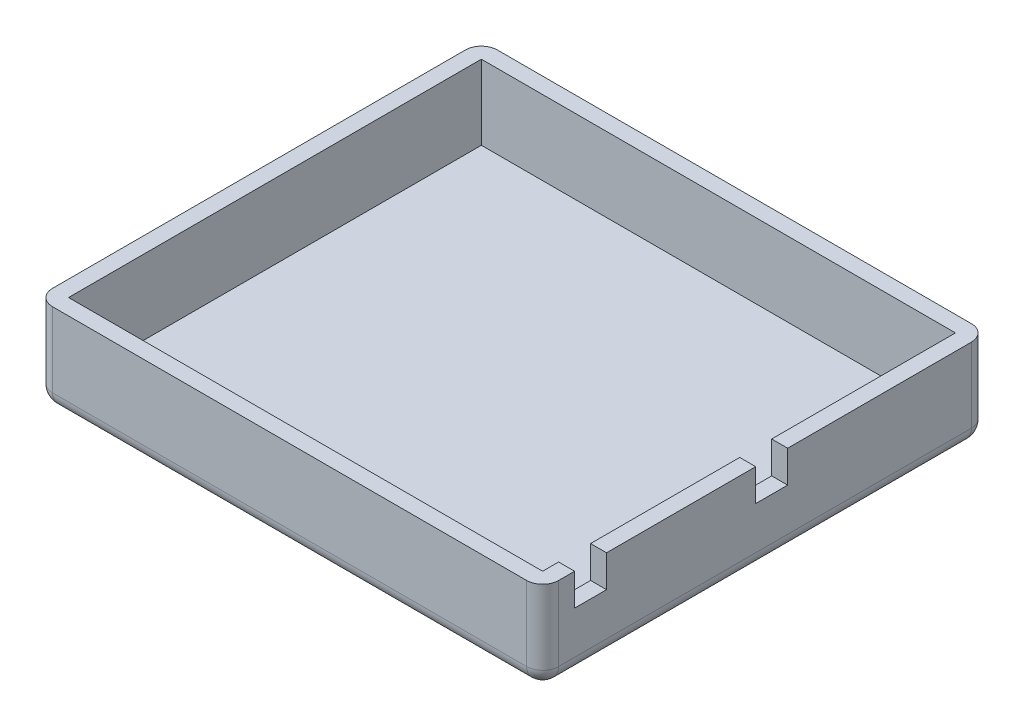
ISO-10303-21;
HEADER;
FILE_DESCRIPTION(('STEP AP214'),'2;1');
FILE_NAME('part.step','',(''),(''),'','','');
FILE_SCHEMA(('AUTOMOTIVE_DESIGN { 1 0 10303 214 1 1 1 1 }'));
ENDSEC;
DATA;
#1=APPLICATION_CONTEXT('core data for automotive mechanical design processes');
#2=APPLICATION_PROTOCOL_DEFINITION('international standard','automotive_design',2000,#1);
#3=PRODUCT_CONTEXT('',#1,'mechanical');
#4=PRODUCT('Part','Part','',(#3));
#5=PRODUCT_RELATED_PRODUCT_CATEGORY('part','',(#4));
#6=PRODUCT_DEFINITION_FORMATION('','',#4);
#7=PRODUCT_DEFINITION_CONTEXT('part definition',#1,'design');
#8=PRODUCT_DEFINITION('design','',#6,#7);
#9=PRODUCT_DEFINITION_SHAPE('','',#8);
#10=(LENGTH_UNIT() NAMED_UNIT(*) SI_UNIT(.MILLI.,.METRE.));
#11=(NAMED_UNIT(*) PLANE_ANGLE_UNIT() SI_UNIT($,.RADIAN.));
#12=(NAMED_UNIT(*) SI_UNIT($,.STERADIAN.) SOLID_ANGLE_UNIT());
#13=UNCERTAINTY_MEASURE_WITH_UNIT(LENGTH_MEASURE(1.E-05),#10,'distance_accuracy_value','');
#14=(GEOMETRIC_REPRESENTATION_CONTEXT(3) GLOBAL_UNCERTAINTY_ASSIGNED_CONTEXT((#13)) GLOBAL_UNIT_ASSIGNED_CONTEXT((#10,
#11,#12)) REPRESENTATION_CONTEXT('',''));
#15=CARTESIAN_POINT('',(0.,0.,0.));
#16=DIRECTION('',(0.,0.,1.));
#17=DIRECTION('',(1.,0.,0.));
#18=AXIS2_PLACEMENT_3D('',#15,#16,#17);
#19=CARTESIAN_POINT('',(0.,17.,0.));
#20=DIRECTION('',(0.,-1.,0.));
#21=DIRECTION('',(0.,0.,-1.));
#22=AXIS2_PLACEMENT_3D('',#19,#20,#21);
#23=PLANE('',#22);
#24=DIRECTION('',(-1.,0.,0.));
#25=VECTOR('',#24,1.);
#26=CARTESIAN_POINT('',(-47.5,17.,-41.75));
#27=LINE('',#26,#25);
#28=CARTESIAN_POINT('',(44.5,17.,-41.75));
#29=VERTEX_POINT('',#28);
#30=CARTESIAN_POINT('',(-44.5,17.,-41.75));
#31=VERTEX_POINT('',#30);
#32=EDGE_CURVE('E195',#29,#31,#27,.T.);
#33=ORIENTED_EDGE('',*,*,#32,.T.);
#34=CARTESIAN_POINT('',(-44.5,17.,-38.75));
#35=DIRECTION('',(0.,-1.,0.));
#36=DIRECTION('',(0.,0.,-1.));
#37=AXIS2_PLACEMENT_3D('',#34,#35,#36);
#38=CIRCLE('',#37,3.);
#39=CARTESIAN_POINT('',(-47.5,17.,-38.75));
#40=VERTEX_POINT('',#39);
#41=EDGE_CURVE('E323',#31,#40,#38,.F.);
#42=ORIENTED_EDGE('',*,*,#41,.T.);
#43=DIRECTION('',(0.,0.,1.));
#44=VECTOR('',#43,1.);
#45=CARTESIAN_POINT('',(-47.5,17.,41.75));
#46=LINE('',#45,#44);
#47=CARTESIAN_POINT('',(-47.5,17.,38.75));
#48=VERTEX_POINT('',#47);
#49=EDGE_CURVE('E279',#40,#48,#46,.T.);
#50=ORIENTED_EDGE('',*,*,#49,.T.);
#51=CARTESIAN_POINT('',(-44.5,17.,38.75));
#52=DIRECTION('',(0.,-1.,0.));
#53=DIRECTION('',(0.,0.,-1.));
#54=AXIS2_PLACEMENT_3D('',#51,#52,#53);
#55=CIRCLE('',#54,3.);
#56=CARTESIAN_POINT('',(-44.5,17.,41.75));
#57=VERTEX_POINT('',#56);
#58=EDGE_CURVE('E318',#48,#57,#55,.F.);
#59=ORIENTED_EDGE('',*,*,#58,.T.);
#60=DIRECTION('',(1.,0.,0.));
#61=VECTOR('',#60,1.);
#62=CARTESIAN_POINT('',(-47.5,17.,41.75));
#63=LINE('',#62,#61);
#64=CARTESIAN_POINT('',(44.5,17.,41.75));
#65=VERTEX_POINT('',#64);
#66=EDGE_CURVE('E282',#57,#65,#63,.T.);
#67=ORIENTED_EDGE('',*,*,#66,.T.);
#68=CARTESIAN_POINT('',(44.5,17.,38.75));
#69=DIRECTION('',(0.,-1.,0.));
#70=DIRECTION('',(0.,0.,-1.));
#71=AXIS2_PLACEMENT_3D('',#68,#69,#70);
#72=CIRCLE('',#71,3.);
#73=CARTESIAN_POINT('',(47.5,17.,38.75));
#74=VERTEX_POINT('',#73);
#75=EDGE_CURVE('E191',#65,#74,#72,.F.);
#76=ORIENTED_EDGE('',*,*,#75,.T.);
#77=DIRECTION('',(0.,0.,-1.));
#78=VECTOR('',#77,1.);
#79=CARTESIAN_POINT('',(47.5,17.,41.75));
#80=LINE('',#79,#78);
#81=CARTESIAN_POINT('',(47.5,17.,35.75));
#82=VERTEX_POINT('',#81);
#83=EDGE_CURVE('E183',#74,#82,#80,.T.);
#84=ORIENTED_EDGE('',*,*,#83,.T.);
#85=DIRECTION('',(1.,0.,0.));
#86=VECTOR('',#85,1.);
#87=CARTESIAN_POINT('',(-47.501,17.,35.75));
#88=LINE('',#87,#86);
#89=CARTESIAN_POINT('',(44.5,17.,35.75));
#90=VERTEX_POINT('',#89);
#91=EDGE_CURVE('E187',#90,#82,#88,.T.);
#92=ORIENTED_EDGE('',*,*,#91,.F.);
#93=DIRECTION('',(0.,0.,-1.));
#94=VECTOR('',#93,1.);
#95=CARTESIAN_POINT('',(44.5,17.,38.75));
#96=LINE('',#95,#94);
#97=CARTESIAN_POINT('',(44.5,17.,38.75));
#98=VERTEX_POINT('',#97);
#99=EDGE_CURVE('E255',#98,#90,#96,.T.);
#100=ORIENTED_EDGE('',*,*,#99,.F.);
#101=DIRECTION('',(1.,0.,0.));
#102=VECTOR('',#101,1.);
#103=CARTESIAN_POINT('',(-44.5,17.,38.75));
#104=LINE('',#103,#102);
#105=CARTESIAN_POINT('',(-44.5,17.,38.75));
#106=VERTEX_POINT('',#105);
#107=EDGE_CURVE('E264',#106,#98,#104,.T.);
#108=ORIENTED_EDGE('',*,*,#107,.F.);
#109=DIRECTION('',(0.,0.,1.));
#110=VECTOR('',#109,1.);
#111=CARTESIAN_POINT('',(-44.5,17.,38.75));
#112=LINE('',#111,#110);
#113=CARTESIAN_POINT('',(-44.5,17.,-38.75));
#114=VERTEX_POINT('',#113);
#115=EDGE_CURVE('E261',#114,#106,#112,.T.);
#116=ORIENTED_EDGE('',*,*,#115,.F.);
#117=DIRECTION('',(-1.,0.,0.));
#118=VECTOR('',#117,1.);
#119=CARTESIAN_POINT('',(-44.5,17.,-38.75));
#120=LINE('',#119,#118);
#121=CARTESIAN_POINT('',(44.5,17.,-38.75));
#122=VERTEX_POINT('',#121);
#123=EDGE_CURVE('E257',#122,#114,#120,.T.);
#124=ORIENTED_EDGE('',*,*,#123,.F.);
#125=CARTESIAN_POINT('',(44.5,17.,-4.25000000000001));
#126=VERTEX_POINT('',#125);
#127=EDGE_CURVE('E259',#126,#122,#96,.T.);
#128=ORIENTED_EDGE('',*,*,#127,.F.);
#129=DIRECTION('',(1.,0.,0.));
#130=VECTOR('',#129,1.);
#131=CARTESIAN_POINT('',(-47.501,17.,-4.25000000000001));
#132=LINE('',#131,#130);
#133=CARTESIAN_POINT('',(47.5,17.,-4.25000000000001));
#134=VERTEX_POINT('',#133);
#135=EDGE_CURVE('E234',#126,#134,#132,.T.);
#136=ORIENTED_EDGE('',*,*,#135,.T.);
#137=CARTESIAN_POINT('',(47.5,17.,-38.75));
#138=VERTEX_POINT('',#137);
#139=EDGE_CURVE('E198',#134,#138,#80,.T.);
#140=ORIENTED_EDGE('',*,*,#139,.T.);
#141=CARTESIAN_POINT('',(44.5,17.,-38.75));
#142=DIRECTION('',(0.,-1.,0.));
#143=DIRECTION('',(0.,0.,-1.));
#144=AXIS2_PLACEMENT_3D('',#141,#142,#143);
#145=CIRCLE('',#144,3.);
#146=EDGE_CURVE('E321',#138,#29,#145,.F.);
#147=ORIENTED_EDGE('',*,*,#146,.T.);
#148=EDGE_LOOP('',(#33,#42,#50,#59,#67,#76,#84,#92,#100,#108,#116,#124,#128,#136,#140,#147));
#149=FACE_BOUND('',#148,.T.);
#150=ADVANCED_FACE('F35',(#149),#23,.F.);
#151=CARTESIAN_POINT('',(0.,3.,41.75));
#152=DIRECTION('',(0.,0.,-1.));
#153=DIRECTION('',(-1.,0.,0.));
#154=AXIS2_PLACEMENT_3D('',#151,#152,#153);
#155=PLANE('',#154);
#156=DIRECTION('',(1.,0.,0.));
#157=VECTOR('',#156,1.);
#158=CARTESIAN_POINT('',(0.,3.,41.75));
#159=LINE('',#158,#157);
#160=CARTESIAN_POINT('',(-44.5,3.,41.75));
#161=VERTEX_POINT('',#160);
#162=CARTESIAN_POINT('',(44.5,3.,41.75));
#163=VERTEX_POINT('',#162);
#164=EDGE_CURVE('E44',#161,#163,#159,.T.);
#165=ORIENTED_EDGE('',*,*,#164,.T.);
#166=DIRECTION('',(0.,-1.,0.));
#167=VECTOR('',#166,1.);
#168=CARTESIAN_POINT('',(44.5,3.,41.75));
#169=LINE('',#168,#167);
#170=EDGE_CURVE('E11',#163,#65,#169,.F.);
#171=ORIENTED_EDGE('',*,*,#170,.T.);
#172=ORIENTED_EDGE('',*,*,#66,.F.);
#173=DIRECTION('',(0.,-1.,0.));
#174=VECTOR('',#173,1.);
#175=CARTESIAN_POINT('',(-44.5,0.,41.75));
#176=LINE('',#175,#174);
#177=EDGE_CURVE('E55',#57,#161,#176,.T.);
#178=ORIENTED_EDGE('',*,*,#177,.T.);
#179=EDGE_LOOP('',(#165,#171,#172,#178));
#180=FACE_BOUND('',#179,.T.);
#181=ADVANCED_FACE('F430',(#180),#155,.F.);
#182=CARTESIAN_POINT('',(47.5,3.,0.));
#183=DIRECTION('',(-1.,0.,0.));
#184=DIRECTION('',(0.,0.,1.));
#185=AXIS2_PLACEMENT_3D('',#182,#183,#184);
#186=PLANE('',#185);
#187=DIRECTION('',(0.,0.,-1.));
#188=VECTOR('',#187,1.);
#189=CARTESIAN_POINT('',(47.5,3.,0.));
#190=LINE('',#189,#188);
#191=CARTESIAN_POINT('',(47.5,3.,38.75));
#192=VERTEX_POINT('',#191);
#193=CARTESIAN_POINT('',(47.5,3.,-38.75));
#194=VERTEX_POINT('',#193);
#195=EDGE_CURVE('E327',#192,#194,#190,.T.);
#196=ORIENTED_EDGE('',*,*,#195,.T.);
#197=DIRECTION('',(0.,-1.,0.));
#198=VECTOR('',#197,1.);
#199=CARTESIAN_POINT('',(47.5,17.,-38.75));
#200=LINE('',#199,#198);
#201=EDGE_CURVE('E329',#194,#138,#200,.F.);
#202=ORIENTED_EDGE('',*,*,#201,.T.);
#203=ORIENTED_EDGE('',*,*,#139,.F.);
#204=DIRECTION('',(0.,1.,0.));
#205=VECTOR('',#204,1.);
#206=CARTESIAN_POINT('',(47.5,17.,-4.25000000000001));
#207=LINE('',#206,#205);
#208=CARTESIAN_POINT('',(47.5,11.,-4.25000000000001));
#209=VERTEX_POINT('',#208);
#210=EDGE_CURVE('E223',#209,#134,#207,.T.);
#211=ORIENTED_EDGE('',*,*,#210,.F.);
#212=DIRECTION('',(0.,0.,-1.));
#213=VECTOR('',#212,1.);
#214=CARTESIAN_POINT('',(47.5,11.,1.74999999999999));
#215=LINE('',#214,#213);
#216=CARTESIAN_POINT('',(47.5,11.,1.74999999999999));
#217=VERTEX_POINT('',#216);
#218=EDGE_CURVE('E236',#217,#209,#215,.T.);
#219=ORIENTED_EDGE('',*,*,#218,.F.);
#220=DIRECTION('',(0.,-1.,0.));
#221=VECTOR('',#220,1.);
#222=CARTESIAN_POINT('',(47.5,17.,1.74999999999999));
#223=LINE('',#222,#221);
#224=CARTESIAN_POINT('',(47.5,17.,1.74999999999999));
#225=VERTEX_POINT('',#224);
#226=EDGE_CURVE('E239',#225,#217,#223,.T.);
#227=ORIENTED_EDGE('',*,*,#226,.F.);
#228=CARTESIAN_POINT('',(47.5,17.,29.75));
#229=VERTEX_POINT('',#228);
#230=EDGE_CURVE('E196',#229,#225,#80,.T.);
#231=ORIENTED_EDGE('',*,*,#230,.F.);
#232=DIRECTION('',(0.,1.,0.));
#233=VECTOR('',#232,1.);
#234=CARTESIAN_POINT('',(47.5,17.,29.75));
#235=LINE('',#234,#233);
#236=CARTESIAN_POINT('',(47.5,11.,29.75));
#237=VERTEX_POINT('',#236);
#238=EDGE_CURVE('E216',#237,#229,#235,.T.);
#239=ORIENTED_EDGE('',*,*,#238,.F.);
#240=DIRECTION('',(0.,0.,-1.));
#241=VECTOR('',#240,1.);
#242=CARTESIAN_POINT('',(47.5,11.,35.75));
#243=LINE('',#242,#241);
#244=CARTESIAN_POINT('',(47.5,11.,35.75));
#245=VERTEX_POINT('',#244);
#246=EDGE_CURVE('E213',#245,#237,#243,.T.);
#247=ORIENTED_EDGE('',*,*,#246,.F.);
#248=DIRECTION('',(0.,-1.,0.));
#249=VECTOR('',#248,1.);
#250=CARTESIAN_POINT('',(47.5,17.,35.75));
#251=LINE('',#250,#249);
#252=EDGE_CURVE('E203',#82,#245,#251,.T.);
#253=ORIENTED_EDGE('',*,*,#252,.F.);
#254=ORIENTED_EDGE('',*,*,#83,.F.);
#255=DIRECTION('',(0.,-1.,0.));
#256=VECTOR('',#255,1.);
#257=CARTESIAN_POINT('',(47.5,3.,38.75));
#258=LINE('',#257,#256);
#259=EDGE_CURVE('E325',#74,#192,#258,.T.);
#260=ORIENTED_EDGE('',*,*,#259,.T.);
#261=EDGE_LOOP('',(#196,#202,#203,#211,#219,#227,#231,#239,#247,#253,#254,#260));
#262=FACE_BOUND('',#261,.T.);
#263=ADVANCED_FACE('F210',(#262),#186,.F.);
#264=CARTESIAN_POINT('',(0.,3.,-41.75));
#265=DIRECTION('',(0.,0.,-1.));
#266=DIRECTION('',(-1.,0.,0.));
#267=AXIS2_PLACEMENT_3D('',#264,#265,#266);
#268=PLANE('',#267);
#269=DIRECTION('',(1.,0.,0.));
#270=VECTOR('',#269,1.);
#271=CARTESIAN_POINT('',(-47.5,3.,-41.75));
#272=LINE('',#271,#270);
#273=CARTESIAN_POINT('',(44.5,3.,-41.75));
#274=VERTEX_POINT('',#273);
#275=CARTESIAN_POINT('',(-44.5,3.,-41.75));
#276=VERTEX_POINT('',#275);
#277=EDGE_CURVE('E314',#274,#276,#272,.F.);
#278=ORIENTED_EDGE('',*,*,#277,.T.);
#279=DIRECTION('',(0.,-1.,0.));
#280=VECTOR('',#279,1.);
#281=CARTESIAN_POINT('',(-44.5,3.,-41.75));
#282=LINE('',#281,#280);
#283=EDGE_CURVE('E316',#276,#31,#282,.F.);
#284=ORIENTED_EDGE('',*,*,#283,.T.);
#285=ORIENTED_EDGE('',*,*,#32,.F.);
#286=DIRECTION('',(0.,-1.,0.));
#287=VECTOR('',#286,1.);
#288=CARTESIAN_POINT('',(44.5,0.,-41.75));
#289=LINE('',#288,#287);
#290=EDGE_CURVE('E312',#29,#274,#289,.T.);
#291=ORIENTED_EDGE('',*,*,#290,.T.);
#292=EDGE_LOOP('',(#278,#284,#285,#291));
#293=FACE_BOUND('',#292,.T.);
#294=ADVANCED_FACE('F396',(#293),#268,.T.);
#295=CARTESIAN_POINT('',(-47.5,3.,0.));
#296=DIRECTION('',(-1.,0.,0.));
#297=DIRECTION('',(0.,0.,1.));
#298=AXIS2_PLACEMENT_3D('',#295,#296,#297);
#299=PLANE('',#298);
#300=ORIENTED_EDGE('',*,*,#49,.F.);
#301=DIRECTION('',(0.,-1.,0.));
#302=VECTOR('',#301,1.);
#303=CARTESIAN_POINT('',(-47.5,3.,-38.75));
#304=LINE('',#303,#302);
#305=CARTESIAN_POINT('',(-47.5,3.,-38.75));
#306=VERTEX_POINT('',#305);
#307=EDGE_CURVE('E310',#40,#306,#304,.T.);
#308=ORIENTED_EDGE('',*,*,#307,.T.);
#309=DIRECTION('',(0.,0.,-1.));
#310=VECTOR('',#309,1.);
#311=CARTESIAN_POINT('',(-47.5,3.,41.75));
#312=LINE('',#311,#310);
#313=CARTESIAN_POINT('',(-47.5,3.,38.75));
#314=VERTEX_POINT('',#313);
#315=EDGE_CURVE('E307',#306,#314,#312,.F.);
#316=ORIENTED_EDGE('',*,*,#315,.T.);
#317=DIRECTION('',(0.,-1.,0.));
#318=VECTOR('',#317,1.);
#319=CARTESIAN_POINT('',(-47.5,17.,38.75));
#320=LINE('',#319,#318);
#321=EDGE_CURVE('E305',#314,#48,#320,.F.);
#322=ORIENTED_EDGE('',*,*,#321,.T.);
#323=EDGE_LOOP('',(#300,#308,#316,#322));
#324=FACE_BOUND('',#323,.T.);
#325=ADVANCED_FACE('F414',(#324),#299,.T.);
#326=CARTESIAN_POINT('',(0.,0.,0.));
#327=DIRECTION('',(0.,1.,0.));
#328=DIRECTION('',(0.,0.,1.));
#329=AXIS2_PLACEMENT_3D('',#326,#327,#328);
#330=PLANE('',#329);
#331=DIRECTION('',(1.,0.,0.));
#332=VECTOR('',#331,1.);
#333=CARTESIAN_POINT('',(0.,0.,38.75));
#334=LINE('',#333,#332);
#335=CARTESIAN_POINT('',(44.5,0.,38.75));
#336=VERTEX_POINT('',#335);
#337=CARTESIAN_POINT('',(-44.5,0.,38.75));
#338=VERTEX_POINT('',#337);
#339=EDGE_CURVE('E296',#336,#338,#334,.F.);
#340=ORIENTED_EDGE('',*,*,#339,.T.);
#341=DIRECTION('',(0.,0.,-1.));
#342=VECTOR('',#341,1.);
#343=CARTESIAN_POINT('',(-44.5,0.,-41.75));
#344=LINE('',#343,#342);
#345=CARTESIAN_POINT('',(-44.5,0.,-38.75));
#346=VERTEX_POINT('',#345);
#347=EDGE_CURVE('E302',#338,#346,#344,.T.);
#348=ORIENTED_EDGE('',*,*,#347,.T.);
#349=DIRECTION('',(1.,0.,0.));
#350=VECTOR('',#349,1.);
#351=CARTESIAN_POINT('',(47.5,0.,-38.75));
#352=LINE('',#351,#350);
#353=CARTESIAN_POINT('',(44.5,0.,-38.75));
#354=VERTEX_POINT('',#353);
#355=EDGE_CURVE('E300',#346,#354,#352,.T.);
#356=ORIENTED_EDGE('',*,*,#355,.T.);
#357=DIRECTION('',(0.,0.,-1.));
#358=VECTOR('',#357,1.);
#359=CARTESIAN_POINT('',(44.5,0.,0.));
#360=LINE('',#359,#358);
#361=EDGE_CURVE('E298',#354,#336,#360,.F.);
#362=ORIENTED_EDGE('',*,*,#361,.T.);
#363=EDGE_LOOP('',(#340,#348,#356,#362));
#364=FACE_BOUND('',#363,.T.);
#365=ADVANCED_FACE('F376',(#364),#330,.F.);
#366=CARTESIAN_POINT('',(44.5,17.,29.75));
#367=VERTEX_POINT('',#366);
#368=CARTESIAN_POINT('',(44.5,17.,1.74999999999999));
#369=VERTEX_POINT('',#368);
#370=EDGE_CURVE('E258',#367,#369,#96,.T.);
#371=ORIENTED_EDGE('',*,*,#370,.F.);
#372=DIRECTION('',(1.,0.,0.));
#373=VECTOR('',#372,1.);
#374=CARTESIAN_POINT('',(-47.501,17.,29.75));
#375=LINE('',#374,#373);
#376=EDGE_CURVE('E225',#367,#229,#375,.T.);
#377=ORIENTED_EDGE('',*,*,#376,.T.);
#378=ORIENTED_EDGE('',*,*,#230,.T.);
#379=DIRECTION('',(1.,0.,0.));
#380=VECTOR('',#379,1.);
#381=CARTESIAN_POINT('',(-47.501,17.,1.74999999999999));
#382=LINE('',#381,#380);
#383=EDGE_CURVE('E249',#369,#225,#382,.T.);
#384=ORIENTED_EDGE('',*,*,#383,.F.);
#385=EDGE_LOOP('',(#371,#377,#378,#384));
#386=FACE_BOUND('',#385,.T.);
#387=ADVANCED_FACE('F432',(#386),#23,.F.);
#388=CARTESIAN_POINT('',(44.5,17.,38.75));
#389=DIRECTION('',(-1.,0.,0.));
#390=DIRECTION('',(0.,0.,1.));
#391=AXIS2_PLACEMENT_3D('',#388,#389,#390);
#392=PLANE('',#391);
#393=DIRECTION('',(0.,-1.,0.));
#394=VECTOR('',#393,1.);
#395=CARTESIAN_POINT('',(44.5,17.,35.75));
#396=LINE('',#395,#394);
#397=CARTESIAN_POINT('',(44.5,11.,35.75));
#398=VERTEX_POINT('',#397);
#399=EDGE_CURVE('E206',#90,#398,#396,.T.);
#400=ORIENTED_EDGE('',*,*,#399,.T.);
#401=DIRECTION('',(0.,0.,-1.));
#402=VECTOR('',#401,1.);
#403=CARTESIAN_POINT('',(44.5,11.,35.75));
#404=LINE('',#403,#402);
#405=CARTESIAN_POINT('',(44.5,11.,29.75));
#406=VERTEX_POINT('',#405);
#407=EDGE_CURVE('E218',#398,#406,#404,.T.);
#408=ORIENTED_EDGE('',*,*,#407,.T.);
#409=DIRECTION('',(0.,1.,0.));
#410=VECTOR('',#409,1.);
#411=CARTESIAN_POINT('',(44.5,17.,29.75));
#412=LINE('',#411,#410);
#413=EDGE_CURVE('E207',#406,#367,#412,.T.);
#414=ORIENTED_EDGE('',*,*,#413,.T.);
#415=ORIENTED_EDGE('',*,*,#370,.T.);
#416=DIRECTION('',(0.,-1.,0.));
#417=VECTOR('',#416,1.);
#418=CARTESIAN_POINT('',(44.5,17.,1.74999999999999));
#419=LINE('',#418,#417);
#420=CARTESIAN_POINT('',(44.5,11.,1.74999999999999));
#421=VERTEX_POINT('',#420);
#422=EDGE_CURVE('E242',#369,#421,#419,.T.);
#423=ORIENTED_EDGE('',*,*,#422,.T.);
#424=DIRECTION('',(0.,0.,-1.));
#425=VECTOR('',#424,1.);
#426=CARTESIAN_POINT('',(44.5,11.,1.74999999999999));
#427=LINE('',#426,#425);
#428=CARTESIAN_POINT('',(44.5,11.,-4.25));
#429=VERTEX_POINT('',#428);
#430=EDGE_CURVE('E230',#421,#429,#427,.T.);
#431=ORIENTED_EDGE('',*,*,#430,.T.);
#432=DIRECTION('',(0.,1.,0.));
#433=VECTOR('',#432,1.);
#434=CARTESIAN_POINT('',(44.5,17.,-4.25000000000001));
#435=LINE('',#434,#433);
#436=EDGE_CURVE('E246',#429,#126,#435,.T.);
#437=ORIENTED_EDGE('',*,*,#436,.T.);
#438=ORIENTED_EDGE('',*,*,#127,.T.);
#439=DIRECTION('',(0.,-1.,0.));
#440=VECTOR('',#439,1.);
#441=CARTESIAN_POINT('',(44.5,17.,-38.75));
#442=LINE('',#441,#440);
#443=CARTESIAN_POINT('',(44.5,3.,-38.75));
#444=VERTEX_POINT('',#443);
#445=EDGE_CURVE('E275',#122,#444,#442,.T.);
#446=ORIENTED_EDGE('',*,*,#445,.T.);
#447=DIRECTION('',(0.,0.,1.));
#448=VECTOR('',#447,1.);
#449=CARTESIAN_POINT('',(44.5,3.,0.));
#450=LINE('',#449,#448);
#451=CARTESIAN_POINT('',(44.5,3.,38.75));
#452=VERTEX_POINT('',#451);
#453=EDGE_CURVE('E293',#444,#452,#450,.T.);
#454=ORIENTED_EDGE('',*,*,#453,.T.);
#455=DIRECTION('',(0.,-1.,0.));
#456=VECTOR('',#455,1.);
#457=CARTESIAN_POINT('',(44.5,17.,38.75));
#458=LINE('',#457,#456);
#459=EDGE_CURVE('E266',#98,#452,#458,.T.);
#460=ORIENTED_EDGE('',*,*,#459,.F.);
#461=ORIENTED_EDGE('',*,*,#99,.T.);
#462=EDGE_LOOP('',(#400,#408,#414,#415,#423,#431,#437,#438,#446,#454,#460,#461));
#463=FACE_BOUND('',#462,.T.);
#464=ADVANCED_FACE('F440',(#463),#392,.T.);
#465=CARTESIAN_POINT('',(-44.5,17.,-38.75));
#466=DIRECTION('',(0.,0.,1.));
#467=DIRECTION('',(1.,0.,0.));
#468=AXIS2_PLACEMENT_3D('',#465,#466,#467);
#469=PLANE('',#468);
#470=DIRECTION('',(0.,-1.,0.));
#471=VECTOR('',#470,1.);
#472=CARTESIAN_POINT('',(-44.5,17.,-38.75));
#473=LINE('',#472,#471);
#474=CARTESIAN_POINT('',(-44.5,3.,-38.75));
#475=VERTEX_POINT('',#474);
#476=EDGE_CURVE('E272',#114,#475,#473,.T.);
#477=ORIENTED_EDGE('',*,*,#476,.T.);
#478=DIRECTION('',(1.,0.,0.));
#479=VECTOR('',#478,1.);
#480=CARTESIAN_POINT('',(0.,3.,-38.75));
#481=LINE('',#480,#479);
#482=EDGE_CURVE('E290',#475,#444,#481,.T.);
#483=ORIENTED_EDGE('',*,*,#482,.T.);
#484=ORIENTED_EDGE('',*,*,#445,.F.);
#485=ORIENTED_EDGE('',*,*,#123,.T.);
#486=EDGE_LOOP('',(#477,#483,#484,#485));
#487=FACE_BOUND('',#486,.T.);
#488=ADVANCED_FACE('F446',(#487),#469,.T.);
#489=CARTESIAN_POINT('',(-44.5,17.,38.75));
#490=DIRECTION('',(1.,0.,0.));
#491=DIRECTION('',(0.,0.,-1.));
#492=AXIS2_PLACEMENT_3D('',#489,#490,#491);
#493=PLANE('',#492);
#494=DIRECTION('',(0.,-1.,0.));
#495=VECTOR('',#494,1.);
#496=CARTESIAN_POINT('',(-44.5,17.,38.75));
#497=LINE('',#496,#495);
#498=CARTESIAN_POINT('',(-44.5,3.,38.75));
#499=VERTEX_POINT('',#498);
#500=EDGE_CURVE('E269',#106,#499,#497,.T.);
#501=ORIENTED_EDGE('',*,*,#500,.T.);
#502=DIRECTION('',(0.,0.,-1.));
#503=VECTOR('',#502,1.);
#504=CARTESIAN_POINT('',(-44.5,3.,0.));
#505=LINE('',#504,#503);
#506=EDGE_CURVE('E287',#499,#475,#505,.T.);
#507=ORIENTED_EDGE('',*,*,#506,.T.);
#508=ORIENTED_EDGE('',*,*,#476,.F.);
#509=ORIENTED_EDGE('',*,*,#115,.T.);
#510=EDGE_LOOP('',(#501,#507,#508,#509));
#511=FACE_BOUND('',#510,.T.);
#512=ADVANCED_FACE('F488',(#511),#493,.T.);
#513=CARTESIAN_POINT('',(-44.5,17.,38.75));
#514=DIRECTION('',(0.,0.,-1.));
#515=DIRECTION('',(-1.,0.,0.));
#516=AXIS2_PLACEMENT_3D('',#513,#514,#515);
#517=PLANE('',#516);
#518=ORIENTED_EDGE('',*,*,#459,.T.);
#519=DIRECTION('',(-1.,0.,0.));
#520=VECTOR('',#519,1.);
#521=CARTESIAN_POINT('',(0.,3.,38.75));
#522=LINE('',#521,#520);
#523=EDGE_CURVE('E284',#452,#499,#522,.T.);
#524=ORIENTED_EDGE('',*,*,#523,.T.);
#525=ORIENTED_EDGE('',*,*,#500,.F.);
#526=ORIENTED_EDGE('',*,*,#107,.T.);
#527=EDGE_LOOP('',(#518,#524,#525,#526));
#528=FACE_BOUND('',#527,.T.);
#529=ADVANCED_FACE('F485',(#528),#517,.T.);
#530=CARTESIAN_POINT('',(0.,3.,0.));
#531=DIRECTION('',(0.,1.,0.));
#532=DIRECTION('',(0.,0.,1.));
#533=AXIS2_PLACEMENT_3D('',#530,#531,#532);
#534=PLANE('',#533);
#535=ORIENTED_EDGE('',*,*,#453,.F.);
#536=ORIENTED_EDGE('',*,*,#482,.F.);
#537=ORIENTED_EDGE('',*,*,#506,.F.);
#538=ORIENTED_EDGE('',*,*,#523,.F.);
#539=EDGE_LOOP('',(#535,#536,#537,#538));
#540=FACE_BOUND('',#539,.T.);
#541=ADVANCED_FACE('F483',(#540),#534,.T.);
#542=CARTESIAN_POINT('',(-47.501,17.,1.74999999999999));
#543=DIRECTION('',(0.,0.,1.));
#544=DIRECTION('',(0.,-1.,0.));
#545=AXIS2_PLACEMENT_3D('',#542,#543,#544);
#546=PLANE('',#545);
#547=ORIENTED_EDGE('',*,*,#383,.T.);
#548=ORIENTED_EDGE('',*,*,#226,.T.);
#549=DIRECTION('',(1.,0.,0.));
#550=VECTOR('',#549,1.);
#551=CARTESIAN_POINT('',(-47.501,11.,1.74999999999999));
#552=LINE('',#551,#550);
#553=EDGE_CURVE('E245',#421,#217,#552,.T.);
#554=ORIENTED_EDGE('',*,*,#553,.F.);
#555=ORIENTED_EDGE('',*,*,#422,.F.);
#556=EDGE_LOOP('',(#547,#548,#554,#555));
#557=FACE_BOUND('',#556,.T.);
#558=ADVANCED_FACE('F479',(#557),#546,.F.);
#559=CARTESIAN_POINT('',(-47.501,17.,-4.25000000000001));
#560=DIRECTION('',(0.,0.,-1.));
#561=DIRECTION('',(-1.,0.,0.));
#562=AXIS2_PLACEMENT_3D('',#559,#560,#561);
#563=PLANE('',#562);
#564=DIRECTION('',(1.,0.,0.));
#565=VECTOR('',#564,1.);
#566=CARTESIAN_POINT('',(-47.501,11.,-4.25000000000001));
#567=LINE('',#566,#565);
#568=EDGE_CURVE('E233',#429,#209,#567,.T.);
#569=ORIENTED_EDGE('',*,*,#568,.T.);
#570=ORIENTED_EDGE('',*,*,#210,.T.);
#571=ORIENTED_EDGE('',*,*,#135,.F.);
#572=ORIENTED_EDGE('',*,*,#436,.F.);
#573=EDGE_LOOP('',(#569,#570,#571,#572));
#574=FACE_BOUND('',#573,.T.);
#575=ADVANCED_FACE('F475',(#574),#563,.F.);
#576=CARTESIAN_POINT('',(-47.501,11.,1.74999999999999));
#577=DIRECTION('',(0.,-1.,0.));
#578=DIRECTION('',(0.,0.,-1.));
#579=AXIS2_PLACEMENT_3D('',#576,#577,#578);
#580=PLANE('',#579);
#581=ORIENTED_EDGE('',*,*,#553,.T.);
#582=ORIENTED_EDGE('',*,*,#218,.T.);
#583=ORIENTED_EDGE('',*,*,#568,.F.);
#584=ORIENTED_EDGE('',*,*,#430,.F.);
#585=EDGE_LOOP('',(#581,#582,#583,#584));
#586=FACE_BOUND('',#585,.T.);
#587=ADVANCED_FACE('F470',(#586),#580,.F.);
#588=CARTESIAN_POINT('',(-47.501,17.,35.75));
#589=DIRECTION('',(0.,0.,1.));
#590=DIRECTION('',(1.,0.,0.));
#591=AXIS2_PLACEMENT_3D('',#588,#589,#590);
#592=PLANE('',#591);
#593=ORIENTED_EDGE('',*,*,#91,.T.);
#594=ORIENTED_EDGE('',*,*,#252,.T.);
#595=DIRECTION('',(1.,0.,0.));
#596=VECTOR('',#595,1.);
#597=CARTESIAN_POINT('',(-47.501,11.,35.75));
#598=LINE('',#597,#596);
#599=EDGE_CURVE('E208',#398,#245,#598,.T.);
#600=ORIENTED_EDGE('',*,*,#599,.F.);
#601=ORIENTED_EDGE('',*,*,#399,.F.);
#602=EDGE_LOOP('',(#593,#594,#600,#601));
#603=FACE_BOUND('',#602,.T.);
#604=ADVANCED_FACE('F201',(#603),#592,.F.);
#605=CARTESIAN_POINT('',(-47.501,17.,29.75));
#606=DIRECTION('',(0.,0.,-1.));
#607=DIRECTION('',(-1.,0.,0.));
#608=AXIS2_PLACEMENT_3D('',#605,#606,#607);
#609=PLANE('',#608);
#610=DIRECTION('',(1.,0.,0.));
#611=VECTOR('',#610,1.);
#612=CARTESIAN_POINT('',(-47.501,11.,29.75));
#613=LINE('',#612,#611);
#614=EDGE_CURVE('E214',#406,#237,#613,.T.);
#615=ORIENTED_EDGE('',*,*,#614,.T.);
#616=ORIENTED_EDGE('',*,*,#238,.T.);
#617=ORIENTED_EDGE('',*,*,#376,.F.);
#618=ORIENTED_EDGE('',*,*,#413,.F.);
#619=EDGE_LOOP('',(#615,#616,#617,#618));
#620=FACE_BOUND('',#619,.T.);
#621=ADVANCED_FACE('F462',(#620),#609,.F.);
#622=CARTESIAN_POINT('',(-47.501,11.,35.75));
#623=DIRECTION('',(0.,-1.,0.));
#624=DIRECTION('',(0.,0.,-1.));
#625=AXIS2_PLACEMENT_3D('',#622,#623,#624);
#626=PLANE('',#625);
#627=ORIENTED_EDGE('',*,*,#599,.T.);
#628=ORIENTED_EDGE('',*,*,#246,.T.);
#629=ORIENTED_EDGE('',*,*,#614,.F.);
#630=ORIENTED_EDGE('',*,*,#407,.F.);
#631=EDGE_LOOP('',(#627,#628,#629,#630));
#632=FACE_BOUND('',#631,.T.);
#633=ADVANCED_FACE('F461',(#632),#626,.F.);
#634=CARTESIAN_POINT('',(44.5,3.,38.75));
#635=DIRECTION('',(0.,-1.,0.));
#636=DIRECTION('',(0.,0.,-1.));
#637=AXIS2_PLACEMENT_3D('',#634,#635,#636);
#638=CYLINDRICAL_SURFACE('',#637,3.);
#639=ORIENTED_EDGE('',*,*,#75,.F.);
#640=ORIENTED_EDGE('',*,*,#170,.F.);
#641=CARTESIAN_POINT('',(44.5,3.,38.75));
#642=DIRECTION('',(0.,-1.,0.));
#643=DIRECTION('',(0.,0.,-1.));
#644=AXIS2_PLACEMENT_3D('',#641,#642,#643);
#645=CIRCLE('',#644,3.);
#646=EDGE_CURVE('E39',#192,#163,#645,.T.);
#647=ORIENTED_EDGE('',*,*,#646,.F.);
#648=ORIENTED_EDGE('',*,*,#259,.F.);
#649=EDGE_LOOP('',(#639,#640,#647,#648));
#650=FACE_BOUND('',#649,.T.);
#651=ADVANCED_FACE('F37',(#650),#638,.T.);
#652=CARTESIAN_POINT('',(44.5,3.,0.));
#653=DIRECTION('',(0.,0.,-1.));
#654=DIRECTION('',(-1.,0.,0.));
#655=AXIS2_PLACEMENT_3D('',#652,#653,#654);
#656=CYLINDRICAL_SURFACE('',#655,3.);
#657=CARTESIAN_POINT('',(44.5,3.,-38.75));
#658=DIRECTION('',(0.,0.,-1.));
#659=DIRECTION('',(-1.,0.,0.));
#660=AXIS2_PLACEMENT_3D('',#657,#658,#659);
#661=CIRCLE('',#660,3.);
#662=EDGE_CURVE('E358',#194,#354,#661,.T.);
#663=ORIENTED_EDGE('',*,*,#662,.F.);
#664=ORIENTED_EDGE('',*,*,#195,.F.);
#665=CARTESIAN_POINT('',(44.5,3.,38.75));
#666=DIRECTION('',(0.,0.,1.));
#667=DIRECTION('',(1.,0.,0.));
#668=AXIS2_PLACEMENT_3D('',#665,#666,#667);
#669=CIRCLE('',#668,3.);
#670=EDGE_CURVE('E360',#336,#192,#669,.T.);
#671=ORIENTED_EDGE('',*,*,#670,.F.);
#672=ORIENTED_EDGE('',*,*,#361,.F.);
#673=EDGE_LOOP('',(#663,#664,#671,#672));
#674=FACE_BOUND('',#673,.T.);
#675=ADVANCED_FACE('F383',(#674),#656,.T.);
#676=CARTESIAN_POINT('',(44.5,3.,-38.75));
#677=DIRECTION('',(0.,1.,0.));
#678=DIRECTION('',(0.,0.,1.));
#679=AXIS2_PLACEMENT_3D('',#676,#677,#678);
#680=CYLINDRICAL_SURFACE('',#679,3.);
#681=ORIENTED_EDGE('',*,*,#146,.F.);
#682=ORIENTED_EDGE('',*,*,#201,.F.);
#683=CARTESIAN_POINT('',(44.5,3.,-38.75));
#684=DIRECTION('',(0.,-1.,0.));
#685=DIRECTION('',(0.,0.,-1.));
#686=AXIS2_PLACEMENT_3D('',#683,#684,#685);
#687=CIRCLE('',#686,3.);
#688=EDGE_CURVE('E355',#274,#194,#687,.T.);
#689=ORIENTED_EDGE('',*,*,#688,.F.);
#690=ORIENTED_EDGE('',*,*,#290,.F.);
#691=EDGE_LOOP('',(#681,#682,#689,#690));
#692=FACE_BOUND('',#691,.T.);
#693=ADVANCED_FACE('F390',(#692),#680,.T.);
#694=CARTESIAN_POINT('',(44.5,3.,38.75));
#695=DIRECTION('',(1.,0.,0.));
#696=DIRECTION('',(0.,0.,-1.));
#697=AXIS2_PLACEMENT_3D('',#694,#695,#696);
#698=SPHERICAL_SURFACE('',#697,3.);
#699=ORIENTED_EDGE('',*,*,#670,.T.);
#700=ORIENTED_EDGE('',*,*,#646,.T.);
#701=CARTESIAN_POINT('',(44.5,3.,38.75));
#702=DIRECTION('',(1.,0.,0.));
#703=DIRECTION('',(0.,0.,-1.));
#704=AXIS2_PLACEMENT_3D('',#701,#702,#703);
#705=CIRCLE('',#704,3.);
#706=EDGE_CURVE('E352',#336,#163,#705,.F.);
#707=ORIENTED_EDGE('',*,*,#706,.F.);
#708=EDGE_LOOP('',(#699,#700,#707));
#709=FACE_BOUND('',#708,.T.);
#710=ADVANCED_FACE('F367',(#709),#698,.T.);
#711=CARTESIAN_POINT('',(44.5,3.,-38.75));
#712=DIRECTION('',(1.,0.,0.));
#713=DIRECTION('',(0.,0.,-1.));
#714=AXIS2_PLACEMENT_3D('',#711,#712,#713);
#715=SPHERICAL_SURFACE('',#714,3.);
#716=ORIENTED_EDGE('',*,*,#688,.T.);
#717=ORIENTED_EDGE('',*,*,#662,.T.);
#718=CARTESIAN_POINT('',(44.5,3.,-38.75));
#719=DIRECTION('',(1.,0.,0.));
#720=DIRECTION('',(0.,0.,-1.));
#721=AXIS2_PLACEMENT_3D('',#718,#719,#720);
#722=CIRCLE('',#721,3.);
#723=EDGE_CURVE('E349',#274,#354,#722,.F.);
#724=ORIENTED_EDGE('',*,*,#723,.F.);
#725=EDGE_LOOP('',(#716,#717,#724));
#726=FACE_BOUND('',#725,.T.);
#727=ADVANCED_FACE('F555',(#726),#715,.T.);
#728=CARTESIAN_POINT('',(-44.5,3.,38.75));
#729=DIRECTION('',(0.,1.,0.));
#730=DIRECTION('',(0.,0.,1.));
#731=AXIS2_PLACEMENT_3D('',#728,#729,#730);
#732=CYLINDRICAL_SURFACE('',#731,3.);
#733=ORIENTED_EDGE('',*,*,#58,.F.);
#734=ORIENTED_EDGE('',*,*,#321,.F.);
#735=CARTESIAN_POINT('',(-44.5,3.,38.75));
#736=DIRECTION('',(0.,-1.,0.));
#737=DIRECTION('',(0.,0.,-1.));
#738=AXIS2_PLACEMENT_3D('',#735,#736,#737);
#739=CIRCLE('',#738,3.);
#740=EDGE_CURVE('E346',#161,#314,#739,.T.);
#741=ORIENTED_EDGE('',*,*,#740,.F.);
#742=ORIENTED_EDGE('',*,*,#177,.F.);
#743=EDGE_LOOP('',(#733,#734,#741,#742));
#744=FACE_BOUND('',#743,.T.);
#745=ADVANCED_FACE('F418',(#744),#732,.T.);
#746=CARTESIAN_POINT('',(0.,3.,38.75));
#747=DIRECTION('',(1.,0.,0.));
#748=DIRECTION('',(0.,0.,-1.));
#749=AXIS2_PLACEMENT_3D('',#746,#747,#748);
#750=CYLINDRICAL_SURFACE('',#749,3.);
#751=ORIENTED_EDGE('',*,*,#706,.T.);
#752=ORIENTED_EDGE('',*,*,#164,.F.);
#753=CARTESIAN_POINT('',(-44.5,3.,38.75));
#754=DIRECTION('',(-1.,0.,0.));
#755=DIRECTION('',(0.,0.,1.));
#756=AXIS2_PLACEMENT_3D('',#753,#754,#755);
#757=CIRCLE('',#756,3.);
#758=EDGE_CURVE('E343',#338,#161,#757,.T.);
#759=ORIENTED_EDGE('',*,*,#758,.F.);
#760=ORIENTED_EDGE('',*,*,#339,.F.);
#761=EDGE_LOOP('',(#751,#752,#759,#760));
#762=FACE_BOUND('',#761,.T.);
#763=ADVANCED_FACE('F371',(#762),#750,.T.);
#764=CARTESIAN_POINT('',(0.,3.,-38.75));
#765=DIRECTION('',(-1.,0.,0.));
#766=DIRECTION('',(0.,0.,1.));
#767=AXIS2_PLACEMENT_3D('',#764,#765,#766);
#768=CYLINDRICAL_SURFACE('',#767,3.);
#769=ORIENTED_EDGE('',*,*,#723,.T.);
#770=ORIENTED_EDGE('',*,*,#355,.F.);
#771=CARTESIAN_POINT('',(-44.5,3.,-38.75));
#772=DIRECTION('',(-1.,0.,0.));
#773=DIRECTION('',(0.,0.,1.));
#774=AXIS2_PLACEMENT_3D('',#771,#772,#773);
#775=CIRCLE('',#774,3.);
#776=EDGE_CURVE('E340',#276,#346,#775,.T.);
#777=ORIENTED_EDGE('',*,*,#776,.F.);
#778=ORIENTED_EDGE('',*,*,#277,.F.);
#779=EDGE_LOOP('',(#769,#770,#777,#778));
#780=FACE_BOUND('',#779,.T.);
#781=ADVANCED_FACE('F406',(#780),#768,.T.);
#782=CARTESIAN_POINT('',(-44.5,3.,-38.75));
#783=DIRECTION('',(0.,-1.,0.));
#784=DIRECTION('',(0.,0.,-1.));
#785=AXIS2_PLACEMENT_3D('',#782,#783,#784);
#786=CYLINDRICAL_SURFACE('',#785,3.);
#787=ORIENTED_EDGE('',*,*,#41,.F.);
#788=ORIENTED_EDGE('',*,*,#283,.F.);
#789=CARTESIAN_POINT('',(-44.5,3.,-38.75));
#790=DIRECTION('',(0.,-1.,0.));
#791=DIRECTION('',(0.,0.,-1.));
#792=AXIS2_PLACEMENT_3D('',#789,#790,#791);
#793=CIRCLE('',#792,3.);
#794=EDGE_CURVE('E337',#306,#276,#793,.T.);
#795=ORIENTED_EDGE('',*,*,#794,.F.);
#796=ORIENTED_EDGE('',*,*,#307,.F.);
#797=EDGE_LOOP('',(#787,#788,#795,#796));
#798=FACE_BOUND('',#797,.T.);
#799=ADVANCED_FACE('F402',(#798),#786,.T.);
#800=CARTESIAN_POINT('',(-44.5,3.,38.75));
#801=DIRECTION('',(0.,0.,1.));
#802=DIRECTION('',(1.,0.,0.));
#803=AXIS2_PLACEMENT_3D('',#800,#801,#802);
#804=SPHERICAL_SURFACE('',#803,3.);
#805=ORIENTED_EDGE('',*,*,#758,.T.);
#806=ORIENTED_EDGE('',*,*,#740,.T.);
#807=CARTESIAN_POINT('',(-44.5,3.,38.75));
#808=DIRECTION('',(0.,0.,1.));
#809=DIRECTION('',(1.,0.,0.));
#810=AXIS2_PLACEMENT_3D('',#807,#808,#809);
#811=CIRCLE('',#810,3.);
#812=EDGE_CURVE('E335',#338,#314,#811,.F.);
#813=ORIENTED_EDGE('',*,*,#812,.F.);
#814=EDGE_LOOP('',(#805,#806,#813));
#815=FACE_BOUND('',#814,.T.);
#816=ADVANCED_FACE('F420',(#815),#804,.T.);
#817=CARTESIAN_POINT('',(-44.5,3.,-38.75));
#818=DIRECTION('',(0.,0.,-1.));
#819=DIRECTION('',(-1.,0.,0.));
#820=AXIS2_PLACEMENT_3D('',#817,#818,#819);
#821=SPHERICAL_SURFACE('',#820,3.);
#822=ORIENTED_EDGE('',*,*,#794,.T.);
#823=ORIENTED_EDGE('',*,*,#776,.T.);
#824=CARTESIAN_POINT('',(-44.5,3.,-38.75));
#825=DIRECTION('',(0.,0.,-1.));
#826=DIRECTION('',(-1.,0.,0.));
#827=AXIS2_PLACEMENT_3D('',#824,#825,#826);
#828=CIRCLE('',#827,3.);
#829=EDGE_CURVE('E333',#306,#346,#828,.F.);
#830=ORIENTED_EDGE('',*,*,#829,.F.);
#831=EDGE_LOOP('',(#822,#823,#830));
#832=FACE_BOUND('',#831,.T.);
#833=ADVANCED_FACE('F409',(#832),#821,.T.);
#834=CARTESIAN_POINT('',(-44.5,3.,0.));
#835=DIRECTION('',(0.,0.,1.));
#836=DIRECTION('',(1.,0.,0.));
#837=AXIS2_PLACEMENT_3D('',#834,#835,#836);
#838=CYLINDRICAL_SURFACE('',#837,3.);
#839=ORIENTED_EDGE('',*,*,#812,.T.);
#840=ORIENTED_EDGE('',*,*,#315,.F.);
#841=ORIENTED_EDGE('',*,*,#829,.T.);
#842=ORIENTED_EDGE('',*,*,#347,.F.);
#843=EDGE_LOOP('',(#839,#840,#841,#842));
#844=FACE_BOUND('',#843,.T.);
#845=ADVANCED_FACE('F411',(#844),#838,.T.);
#846=CLOSED_SHELL('',(#150,#181,#263,#294,#325,#365,#387,#464,#488,#512,#529,#541,#558,#575,
#587,#604,#621,#633,#651,#675,#693,#710,#727,#745,#763,#781,#799,#816,#833,#845));
#847=MANIFOLD_SOLID_BREP('B2',#846);
#848=ADVANCED_BREP_SHAPE_REPRESENTATION('',(#18,#847),#14);
#849=SHAPE_DEFINITION_REPRESENTATION(#9,#848);
ENDSEC;
END-ISO-10303-21;
